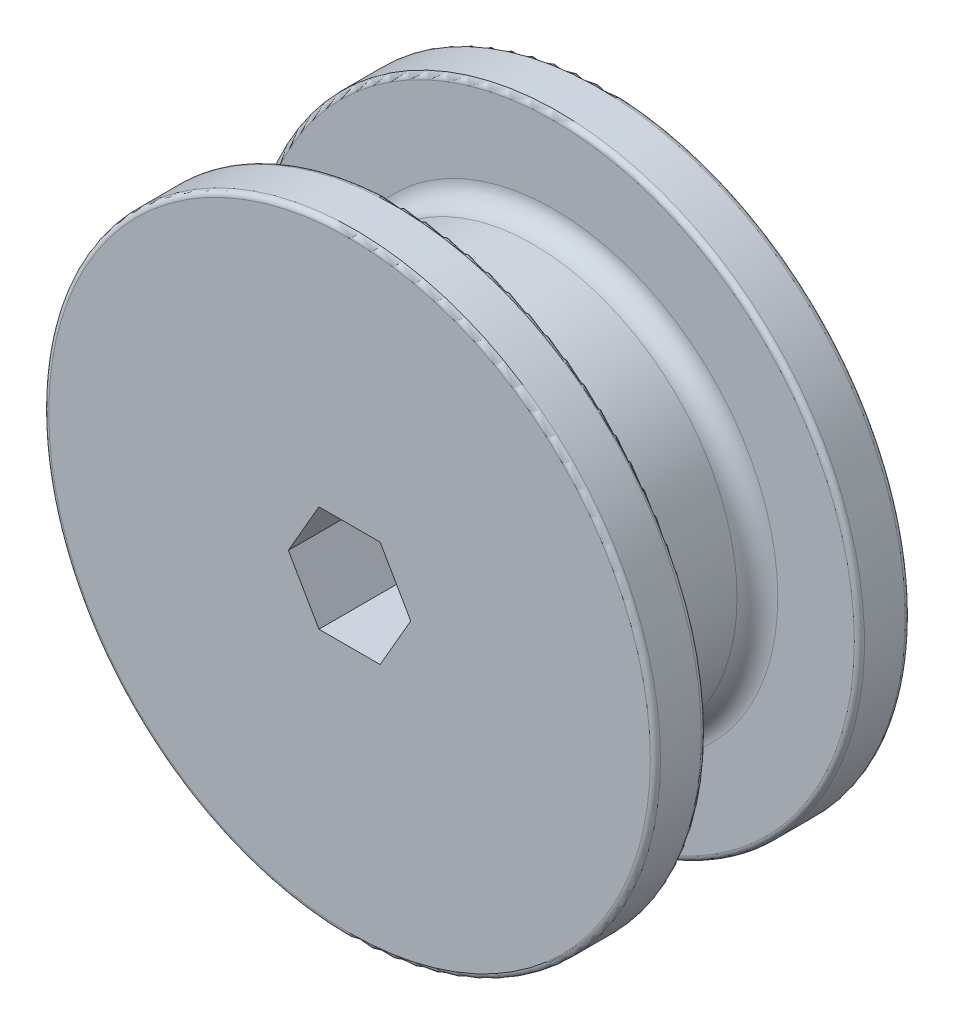
ISO-10303-21;
HEADER;
FILE_DESCRIPTION(('STEP AP214'),'2;1');
FILE_NAME('part.step','',(''),(''),'','','');
FILE_SCHEMA(('AUTOMOTIVE_DESIGN { 1 0 10303 214 1 1 1 1 }'));
ENDSEC;
DATA;
#1=APPLICATION_CONTEXT('core data for automotive mechanical design processes');
#2=APPLICATION_PROTOCOL_DEFINITION('international standard','automotive_design',2000,#1);
#3=PRODUCT_CONTEXT('',#1,'mechanical');
#4=PRODUCT('Part','Part','',(#3));
#5=PRODUCT_RELATED_PRODUCT_CATEGORY('part','',(#4));
#6=PRODUCT_DEFINITION_FORMATION('','',#4);
#7=PRODUCT_DEFINITION_CONTEXT('part definition',#1,'design');
#8=PRODUCT_DEFINITION('design','',#6,#7);
#9=PRODUCT_DEFINITION_SHAPE('','',#8);
#10=(LENGTH_UNIT() NAMED_UNIT(*) SI_UNIT(.MILLI.,.METRE.));
#11=(NAMED_UNIT(*) PLANE_ANGLE_UNIT() SI_UNIT($,.RADIAN.));
#12=(NAMED_UNIT(*) SI_UNIT($,.STERADIAN.) SOLID_ANGLE_UNIT());
#13=UNCERTAINTY_MEASURE_WITH_UNIT(LENGTH_MEASURE(1.E-05),#10,'distance_accuracy_value','');
#14=(GEOMETRIC_REPRESENTATION_CONTEXT(3) GLOBAL_UNCERTAINTY_ASSIGNED_CONTEXT((#13)) GLOBAL_UNIT_ASSIGNED_CONTEXT((#10,
#11,#12)) REPRESENTATION_CONTEXT('',''));
#15=CARTESIAN_POINT('',(0.,0.,0.));
#16=DIRECTION('',(0.,0.,1.));
#17=DIRECTION('',(1.,0.,0.));
#18=AXIS2_PLACEMENT_3D('',#15,#16,#17);
#19=CARTESIAN_POINT('',(0.,0.,19.05));
#20=DIRECTION('',(0.,0.,-1.));
#21=DIRECTION('',(-1.,0.,0.));
#22=AXIS2_PLACEMENT_3D('',#19,#20,#21);
#23=CYLINDRICAL_SURFACE('',#22,25.4);
#24=CARTESIAN_POINT('',(0.,0.,2.54));
#25=DIRECTION('',(0.,0.,-1.));
#26=DIRECTION('',(-1.,0.,0.));
#27=AXIS2_PLACEMENT_3D('',#24,#25,#26);
#28=CIRCLE('',#27,25.4);
#29=CARTESIAN_POINT('',(-25.4,0.,2.54));
#30=VERTEX_POINT('',#29);
#31=EDGE_CURVE('E140',#30,#30,#28,.F.);
#32=ORIENTED_EDGE('',*,*,#31,.T.);
#33=EDGE_LOOP('',(#32));
#34=FACE_BOUND('',#33,.T.);
#35=CARTESIAN_POINT('',(0.,0.,16.51));
#36=DIRECTION('',(0.,0.,1.));
#37=DIRECTION('',(1.,0.,0.));
#38=AXIS2_PLACEMENT_3D('',#35,#36,#37);
#39=CIRCLE('',#38,25.4);
#40=CARTESIAN_POINT('',(25.4,0.,16.51));
#41=VERTEX_POINT('',#40);
#42=EDGE_CURVE('E130',#41,#41,#39,.F.);
#43=ORIENTED_EDGE('',*,*,#42,.T.);
#44=EDGE_LOOP('',(#43));
#45=FACE_BOUND('',#44,.T.);
#46=ADVANCED_FACE('F33',(#34,#45),#23,.T.);
#47=CARTESIAN_POINT('',(0.,0.,25.4));
#48=DIRECTION('',(0.,0.,-1.));
#49=DIRECTION('',(-1.,0.,0.));
#50=AXIS2_PLACEMENT_3D('',#47,#48,#49);
#51=CYLINDRICAL_SURFACE('',#50,38.1);
#52=CARTESIAN_POINT('',(0.,0.,19.685));
#53=DIRECTION('',(0.,0.,1.));
#54=DIRECTION('',(1.,0.,0.));
#55=AXIS2_PLACEMENT_3D('',#52,#53,#54);
#56=CIRCLE('',#55,38.1);
#57=CARTESIAN_POINT('',(38.1,0.,19.685));
#58=VERTEX_POINT('',#57);
#59=EDGE_CURVE('E152',#58,#58,#56,.T.);
#60=ORIENTED_EDGE('',*,*,#59,.T.);
#61=EDGE_LOOP('',(#60));
#62=FACE_BOUND('',#61,.T.);
#63=CARTESIAN_POINT('',(0.,0.,24.765));
#64=DIRECTION('',(0.,0.,1.));
#65=DIRECTION('',(1.,0.,0.));
#66=AXIS2_PLACEMENT_3D('',#63,#64,#65);
#67=CIRCLE('',#66,38.1);
#68=CARTESIAN_POINT('',(38.1,0.,24.765));
#69=VERTEX_POINT('',#68);
#70=EDGE_CURVE('E149',#69,#69,#67,.F.);
#71=ORIENTED_EDGE('',*,*,#70,.T.);
#72=EDGE_LOOP('',(#71));
#73=FACE_BOUND('',#72,.T.);
#74=ADVANCED_FACE('F197',(#62,#73),#51,.T.);
#75=CARTESIAN_POINT('',(0.,0.,25.4));
#76=DIRECTION('',(0.,0.,1.));
#77=DIRECTION('',(1.,0.,0.));
#78=AXIS2_PLACEMENT_3D('',#75,#76,#77);
#79=PLANE('',#78);
#80=CARTESIAN_POINT('',(0.,0.,25.4));
#81=DIRECTION('',(0.,0.,1.));
#82=DIRECTION('',(1.,0.,0.));
#83=AXIS2_PLACEMENT_3D('',#80,#81,#82);
#84=CIRCLE('',#83,37.465);
#85=CARTESIAN_POINT('',(37.465,0.,25.4));
#86=VERTEX_POINT('',#85);
#87=EDGE_CURVE('E158',#86,#86,#84,.T.);
#88=ORIENTED_EDGE('',*,*,#87,.T.);
#89=EDGE_LOOP('',(#88));
#90=FACE_BOUND('',#89,.T.);
#91=DIRECTION('',(0.5,0.866025403784439,0.));
#92=VECTOR('',#91,1.);
#93=CARTESIAN_POINT('',(3.81051177665153,-6.60000000000001,25.4));
#94=LINE('',#93,#92);
#95=CARTESIAN_POINT('',(3.81051177665153,-6.60000000000001,25.4));
#96=VERTEX_POINT('',#95);
#97=CARTESIAN_POINT('',(7.62102355330306,0.,25.4));
#98=VERTEX_POINT('',#97);
#99=EDGE_CURVE('E48',#96,#98,#94,.T.);
#100=ORIENTED_EDGE('',*,*,#99,.F.);
#101=DIRECTION('',(1.,0.,0.));
#102=VECTOR('',#101,1.);
#103=CARTESIAN_POINT('',(-3.81051177665153,-6.6,25.4));
#104=LINE('',#103,#102);
#105=CARTESIAN_POINT('',(-3.81051177665153,-6.6,25.4));
#106=VERTEX_POINT('',#105);
#107=EDGE_CURVE('E104',#106,#96,#104,.T.);
#108=ORIENTED_EDGE('',*,*,#107,.F.);
#109=DIRECTION('',(0.5,-0.866025403784439,0.));
#110=VECTOR('',#109,1.);
#111=CARTESIAN_POINT('',(-7.62102355330307,0.,25.4));
#112=LINE('',#111,#110);
#113=CARTESIAN_POINT('',(-7.62102355330307,0.,25.4));
#114=VERTEX_POINT('',#113);
#115=EDGE_CURVE('E107',#114,#106,#112,.T.);
#116=ORIENTED_EDGE('',*,*,#115,.F.);
#117=DIRECTION('',(-0.5,-0.866025403784439,0.));
#118=VECTOR('',#117,1.);
#119=CARTESIAN_POINT('',(-3.81051177665153,6.60000000000001,25.4));
#120=LINE('',#119,#118);
#121=CARTESIAN_POINT('',(-3.81051177665153,6.60000000000001,25.4));
#122=VERTEX_POINT('',#121);
#123=EDGE_CURVE('E123',#122,#114,#120,.T.);
#124=ORIENTED_EDGE('',*,*,#123,.F.);
#125=DIRECTION('',(-1.,0.,0.));
#126=VECTOR('',#125,1.);
#127=CARTESIAN_POINT('',(3.81051177665153,6.60000000000001,25.4));
#128=LINE('',#127,#126);
#129=CARTESIAN_POINT('',(3.81051177665153,6.60000000000001,25.4));
#130=VERTEX_POINT('',#129);
#131=EDGE_CURVE('E120',#130,#122,#128,.T.);
#132=ORIENTED_EDGE('',*,*,#131,.F.);
#133=DIRECTION('',(-0.5,0.866025403784439,0.));
#134=VECTOR('',#133,1.);
#135=CARTESIAN_POINT('',(7.62102355330306,0.,25.4));
#136=LINE('',#135,#134);
#137=EDGE_CURVE('E118',#98,#130,#136,.T.);
#138=ORIENTED_EDGE('',*,*,#137,.F.);
#139=EDGE_LOOP('',(#100,#108,#116,#124,#132,#138));
#140=FACE_BOUND('',#139,.T.);
#141=ADVANCED_FACE('F205',(#90,#140),#79,.T.);
#142=CARTESIAN_POINT('',(0.,0.,19.05));
#143=DIRECTION('',(0.,0.,1.));
#144=DIRECTION('',(1.,0.,0.));
#145=AXIS2_PLACEMENT_3D('',#142,#143,#144);
#146=PLANE('',#145);
#147=CARTESIAN_POINT('',(0.,0.,19.05));
#148=DIRECTION('',(0.,0.,1.));
#149=DIRECTION('',(1.,0.,0.));
#150=AXIS2_PLACEMENT_3D('',#147,#148,#149);
#151=CIRCLE('',#150,37.465);
#152=CARTESIAN_POINT('',(37.465,0.,19.05));
#153=VERTEX_POINT('',#152);
#154=EDGE_CURVE('E155',#153,#153,#151,.F.);
#155=ORIENTED_EDGE('',*,*,#154,.T.);
#156=EDGE_LOOP('',(#155));
#157=FACE_BOUND('',#156,.T.);
#158=CARTESIAN_POINT('',(0.,0.,19.05));
#159=DIRECTION('',(0.,0.,1.));
#160=DIRECTION('',(1.,0.,0.));
#161=AXIS2_PLACEMENT_3D('',#158,#159,#160);
#162=CIRCLE('',#161,27.94);
#163=CARTESIAN_POINT('',(27.94,0.,19.05));
#164=VERTEX_POINT('',#163);
#165=EDGE_CURVE('E146',#164,#164,#162,.T.);
#166=ORIENTED_EDGE('',*,*,#165,.T.);
#167=EDGE_LOOP('',(#166));
#168=FACE_BOUND('',#167,.T.);
#169=ADVANCED_FACE('F181',(#157,#168),#146,.F.);
#170=CARTESIAN_POINT('',(0.,0.,-6.35));
#171=DIRECTION('',(0.,0.,1.));
#172=DIRECTION('',(1.,0.,0.));
#173=AXIS2_PLACEMENT_3D('',#170,#171,#172);
#174=CYLINDRICAL_SURFACE('',#173,38.1);
#175=CARTESIAN_POINT('',(0.,0.,-0.635));
#176=DIRECTION('',(0.,0.,-1.));
#177=DIRECTION('',(-1.,0.,0.));
#178=AXIS2_PLACEMENT_3D('',#175,#176,#177);
#179=CIRCLE('',#178,38.1);
#180=CARTESIAN_POINT('',(-38.1,0.,-0.635));
#181=VERTEX_POINT('',#180);
#182=EDGE_CURVE('E164',#181,#181,#179,.T.);
#183=ORIENTED_EDGE('',*,*,#182,.T.);
#184=EDGE_LOOP('',(#183));
#185=FACE_BOUND('',#184,.T.);
#186=CARTESIAN_POINT('',(0.,0.,-5.715));
#187=DIRECTION('',(0.,0.,-1.));
#188=DIRECTION('',(-1.,0.,0.));
#189=AXIS2_PLACEMENT_3D('',#186,#187,#188);
#190=CIRCLE('',#189,38.1);
#191=CARTESIAN_POINT('',(-38.1,0.,-5.715));
#192=VERTEX_POINT('',#191);
#193=EDGE_CURVE('E161',#192,#192,#190,.F.);
#194=ORIENTED_EDGE('',*,*,#193,.T.);
#195=EDGE_LOOP('',(#194));
#196=FACE_BOUND('',#195,.T.);
#197=ADVANCED_FACE('F178',(#185,#196),#174,.T.);
#198=CARTESIAN_POINT('',(0.,0.,-6.35));
#199=DIRECTION('',(0.,0.,-1.));
#200=DIRECTION('',(-1.,0.,0.));
#201=AXIS2_PLACEMENT_3D('',#198,#199,#200);
#202=PLANE('',#201);
#203=CARTESIAN_POINT('',(0.,0.,-6.35));
#204=DIRECTION('',(0.,0.,-1.));
#205=DIRECTION('',(-1.,0.,0.));
#206=AXIS2_PLACEMENT_3D('',#203,#204,#205);
#207=CIRCLE('',#206,37.465);
#208=CARTESIAN_POINT('',(-37.465,0.,-6.35));
#209=VERTEX_POINT('',#208);
#210=EDGE_CURVE('E11',#209,#209,#207,.T.);
#211=ORIENTED_EDGE('',*,*,#210,.T.);
#212=EDGE_LOOP('',(#211));
#213=FACE_BOUND('',#212,.T.);
#214=DIRECTION('',(0.5,0.866025403784439,0.));
#215=VECTOR('',#214,1.);
#216=CARTESIAN_POINT('',(3.81051177665153,-6.60000000000001,-6.35));
#217=LINE('',#216,#215);
#218=CARTESIAN_POINT('',(3.81051177665153,-6.60000000000001,-6.35));
#219=VERTEX_POINT('',#218);
#220=CARTESIAN_POINT('',(7.62102355330306,0.,-6.35));
#221=VERTEX_POINT('',#220);
#222=EDGE_CURVE('E88',#219,#221,#217,.T.);
#223=ORIENTED_EDGE('',*,*,#222,.T.);
#224=DIRECTION('',(-0.5,0.866025403784439,0.));
#225=VECTOR('',#224,1.);
#226=CARTESIAN_POINT('',(7.62102355330306,0.,-6.35));
#227=LINE('',#226,#225);
#228=CARTESIAN_POINT('',(3.81051177665152,6.60000000000001,-6.35));
#229=VERTEX_POINT('',#228);
#230=EDGE_CURVE('E97',#221,#229,#227,.T.);
#231=ORIENTED_EDGE('',*,*,#230,.T.);
#232=DIRECTION('',(-1.,0.,0.));
#233=VECTOR('',#232,1.);
#234=CARTESIAN_POINT('',(3.81051177665153,6.60000000000001,-6.35));
#235=LINE('',#234,#233);
#236=CARTESIAN_POINT('',(-3.81051177665153,6.60000000000001,-6.35));
#237=VERTEX_POINT('',#236);
#238=EDGE_CURVE('E56',#229,#237,#235,.T.);
#239=ORIENTED_EDGE('',*,*,#238,.T.);
#240=DIRECTION('',(-0.5,-0.866025403784439,0.));
#241=VECTOR('',#240,1.);
#242=CARTESIAN_POINT('',(-3.81051177665153,6.60000000000001,-6.35));
#243=LINE('',#242,#241);
#244=CARTESIAN_POINT('',(-7.62102355330307,0.,-6.35));
#245=VERTEX_POINT('',#244);
#246=EDGE_CURVE('E111',#237,#245,#243,.T.);
#247=ORIENTED_EDGE('',*,*,#246,.T.);
#248=DIRECTION('',(0.5,-0.866025403784439,0.));
#249=VECTOR('',#248,1.);
#250=CARTESIAN_POINT('',(-7.62102355330307,0.,-6.35));
#251=LINE('',#250,#249);
#252=CARTESIAN_POINT('',(-3.81051177665153,-6.6,-6.35));
#253=VERTEX_POINT('',#252);
#254=EDGE_CURVE('E114',#245,#253,#251,.T.);
#255=ORIENTED_EDGE('',*,*,#254,.T.);
#256=DIRECTION('',(1.,0.,0.));
#257=VECTOR('',#256,1.);
#258=CARTESIAN_POINT('',(-3.81051177665153,-6.6,-6.35));
#259=LINE('',#258,#257);
#260=EDGE_CURVE('E94',#253,#219,#259,.T.);
#261=ORIENTED_EDGE('',*,*,#260,.T.);
#262=EDGE_LOOP('',(#223,#231,#239,#247,#255,#261));
#263=FACE_BOUND('',#262,.T.);
#264=ADVANCED_FACE('F101',(#213,#263),#202,.T.);
#265=CARTESIAN_POINT('',(0.,0.,0.));
#266=DIRECTION('',(0.,0.,-1.));
#267=DIRECTION('',(-1.,0.,0.));
#268=AXIS2_PLACEMENT_3D('',#265,#266,#267);
#269=PLANE('',#268);
#270=CARTESIAN_POINT('',(0.,0.,0.));
#271=DIRECTION('',(0.,0.,-1.));
#272=DIRECTION('',(-1.,0.,0.));
#273=AXIS2_PLACEMENT_3D('',#270,#271,#272);
#274=CIRCLE('',#273,37.465);
#275=CARTESIAN_POINT('',(-37.465,0.,0.));
#276=VERTEX_POINT('',#275);
#277=EDGE_CURVE('E41',#276,#276,#274,.F.);
#278=ORIENTED_EDGE('',*,*,#277,.T.);
#279=EDGE_LOOP('',(#278));
#280=FACE_BOUND('',#279,.T.);
#281=CARTESIAN_POINT('',(0.,0.,0.));
#282=DIRECTION('',(0.,0.,-1.));
#283=DIRECTION('',(-1.,0.,0.));
#284=AXIS2_PLACEMENT_3D('',#281,#282,#283);
#285=CIRCLE('',#284,27.94);
#286=CARTESIAN_POINT('',(-27.94,0.,0.));
#287=VERTEX_POINT('',#286);
#288=EDGE_CURVE('E143',#287,#287,#285,.T.);
#289=ORIENTED_EDGE('',*,*,#288,.T.);
#290=EDGE_LOOP('',(#289));
#291=FACE_BOUND('',#290,.T.);
#292=ADVANCED_FACE('F169',(#280,#291),#269,.F.);
#293=CARTESIAN_POINT('',(3.81051177665153,-6.60000000000001,-6.35));
#294=DIRECTION('',(0.866025403784439,-0.5,0.));
#295=DIRECTION('',(0.5,0.866025403784439,0.));
#296=AXIS2_PLACEMENT_3D('',#293,#294,#295);
#297=PLANE('',#296);
#298=ORIENTED_EDGE('',*,*,#99,.T.);
#299=DIRECTION('',(0.,0.,1.));
#300=VECTOR('',#299,1.);
#301=CARTESIAN_POINT('',(7.62102355330306,0.,-6.35));
#302=LINE('',#301,#300);
#303=EDGE_CURVE('E84',#221,#98,#302,.T.);
#304=ORIENTED_EDGE('',*,*,#303,.F.);
#305=ORIENTED_EDGE('',*,*,#222,.F.);
#306=DIRECTION('',(0.,0.,1.));
#307=VECTOR('',#306,1.);
#308=CARTESIAN_POINT('',(3.81051177665153,-6.60000000000001,-6.35));
#309=LINE('',#308,#307);
#310=EDGE_CURVE('E128',#219,#96,#309,.T.);
#311=ORIENTED_EDGE('',*,*,#310,.T.);
#312=EDGE_LOOP('',(#298,#304,#305,#311));
#313=FACE_BOUND('',#312,.T.);
#314=ADVANCED_FACE('F86',(#313),#297,.F.);
#315=CARTESIAN_POINT('',(-3.81051177665153,-6.6,-6.35));
#316=DIRECTION('',(0.,-1.,0.));
#317=DIRECTION('',(1.,0.,0.));
#318=AXIS2_PLACEMENT_3D('',#315,#316,#317);
#319=PLANE('',#318);
#320=ORIENTED_EDGE('',*,*,#107,.T.);
#321=ORIENTED_EDGE('',*,*,#310,.F.);
#322=ORIENTED_EDGE('',*,*,#260,.F.);
#323=DIRECTION('',(0.,0.,1.));
#324=VECTOR('',#323,1.);
#325=CARTESIAN_POINT('',(-3.81051177665153,-6.6,-6.35));
#326=LINE('',#325,#324);
#327=EDGE_CURVE('E131',#253,#106,#326,.T.);
#328=ORIENTED_EDGE('',*,*,#327,.T.);
#329=EDGE_LOOP('',(#320,#321,#322,#328));
#330=FACE_BOUND('',#329,.T.);
#331=ADVANCED_FACE('F246',(#330),#319,.F.);
#332=CARTESIAN_POINT('',(-7.62102355330307,0.,-6.35));
#333=DIRECTION('',(-0.866025403784438,-0.5,0.));
#334=DIRECTION('',(0.5,-0.866025403784439,0.));
#335=AXIS2_PLACEMENT_3D('',#332,#333,#334);
#336=PLANE('',#335);
#337=ORIENTED_EDGE('',*,*,#115,.T.);
#338=ORIENTED_EDGE('',*,*,#327,.F.);
#339=ORIENTED_EDGE('',*,*,#254,.F.);
#340=DIRECTION('',(0.,0.,1.));
#341=VECTOR('',#340,1.);
#342=CARTESIAN_POINT('',(-7.62102355330307,0.,-6.35));
#343=LINE('',#342,#341);
#344=EDGE_CURVE('E133',#245,#114,#343,.T.);
#345=ORIENTED_EDGE('',*,*,#344,.T.);
#346=EDGE_LOOP('',(#337,#338,#339,#345));
#347=FACE_BOUND('',#346,.T.);
#348=ADVANCED_FACE('F244',(#347),#336,.F.);
#349=CARTESIAN_POINT('',(-3.81051177665153,6.60000000000001,-6.35));
#350=DIRECTION('',(-0.866025403784439,0.5,0.));
#351=DIRECTION('',(-0.5,-0.866025403784439,0.));
#352=AXIS2_PLACEMENT_3D('',#349,#350,#351);
#353=PLANE('',#352);
#354=ORIENTED_EDGE('',*,*,#123,.T.);
#355=ORIENTED_EDGE('',*,*,#344,.F.);
#356=ORIENTED_EDGE('',*,*,#246,.F.);
#357=DIRECTION('',(0.,0.,1.));
#358=VECTOR('',#357,1.);
#359=CARTESIAN_POINT('',(-3.81051177665153,6.60000000000001,-6.35));
#360=LINE('',#359,#358);
#361=EDGE_CURVE('E135',#237,#122,#360,.T.);
#362=ORIENTED_EDGE('',*,*,#361,.T.);
#363=EDGE_LOOP('',(#354,#355,#356,#362));
#364=FACE_BOUND('',#363,.T.);
#365=ADVANCED_FACE('F241',(#364),#353,.F.);
#366=CARTESIAN_POINT('',(3.81051177665153,6.60000000000001,-6.35));
#367=DIRECTION('',(0.,1.,0.));
#368=DIRECTION('',(-1.,0.,0.));
#369=AXIS2_PLACEMENT_3D('',#366,#367,#368);
#370=PLANE('',#369);
#371=ORIENTED_EDGE('',*,*,#131,.T.);
#372=ORIENTED_EDGE('',*,*,#361,.F.);
#373=ORIENTED_EDGE('',*,*,#238,.F.);
#374=DIRECTION('',(0.,0.,1.));
#375=VECTOR('',#374,1.);
#376=CARTESIAN_POINT('',(3.81051177665153,6.60000000000001,-6.35));
#377=LINE('',#376,#375);
#378=EDGE_CURVE('E93',#229,#130,#377,.T.);
#379=ORIENTED_EDGE('',*,*,#378,.T.);
#380=EDGE_LOOP('',(#371,#372,#373,#379));
#381=FACE_BOUND('',#380,.T.);
#382=ADVANCED_FACE('F238',(#381),#370,.F.);
#383=CARTESIAN_POINT('',(7.62102355330306,0.,-6.35));
#384=DIRECTION('',(0.866025403784439,0.5,0.));
#385=DIRECTION('',(-0.5,0.866025403784439,0.));
#386=AXIS2_PLACEMENT_3D('',#383,#384,#385);
#387=PLANE('',#386);
#388=ORIENTED_EDGE('',*,*,#137,.T.);
#389=ORIENTED_EDGE('',*,*,#378,.F.);
#390=ORIENTED_EDGE('',*,*,#230,.F.);
#391=ORIENTED_EDGE('',*,*,#303,.T.);
#392=EDGE_LOOP('',(#388,#389,#390,#391));
#393=FACE_BOUND('',#392,.T.);
#394=ADVANCED_FACE('F98',(#393),#387,.F.);
#395=CARTESIAN_POINT('',(0.,0.,2.54));
#396=DIRECTION('',(0.,0.,-1.));
#397=DIRECTION('',(-1.,0.,0.));
#398=AXIS2_PLACEMENT_3D('',#395,#396,#397);
#399=TOROIDAL_SURFACE('',#398,27.94,2.54);
#400=ORIENTED_EDGE('',*,*,#288,.F.);
#401=EDGE_LOOP('',(#400));
#402=FACE_BOUND('',#401,.T.);
#403=ORIENTED_EDGE('',*,*,#31,.F.);
#404=EDGE_LOOP('',(#403));
#405=FACE_BOUND('',#404,.T.);
#406=ADVANCED_FACE('F211',(#402,#405),#399,.F.);
#407=CARTESIAN_POINT('',(0.,0.,16.51));
#408=DIRECTION('',(0.,0.,1.));
#409=DIRECTION('',(1.,0.,0.));
#410=AXIS2_PLACEMENT_3D('',#407,#408,#409);
#411=TOROIDAL_SURFACE('',#410,27.94,2.54);
#412=ORIENTED_EDGE('',*,*,#42,.F.);
#413=EDGE_LOOP('',(#412));
#414=FACE_BOUND('',#413,.T.);
#415=ORIENTED_EDGE('',*,*,#165,.F.);
#416=EDGE_LOOP('',(#415));
#417=FACE_BOUND('',#416,.T.);
#418=ADVANCED_FACE('F214',(#414,#417),#411,.F.);
#419=CARTESIAN_POINT('',(0.,0.,19.685));
#420=DIRECTION('',(0.,0.,1.));
#421=DIRECTION('',(1.,0.,0.));
#422=AXIS2_PLACEMENT_3D('',#419,#420,#421);
#423=TOROIDAL_SURFACE('',#422,37.465,0.635);
#424=ORIENTED_EDGE('',*,*,#154,.F.);
#425=EDGE_LOOP('',(#424));
#426=FACE_BOUND('',#425,.T.);
#427=ORIENTED_EDGE('',*,*,#59,.F.);
#428=EDGE_LOOP('',(#427));
#429=FACE_BOUND('',#428,.T.);
#430=ADVANCED_FACE('F218',(#426,#429),#423,.T.);
#431=CARTESIAN_POINT('',(0.,0.,24.765));
#432=DIRECTION('',(0.,0.,1.));
#433=DIRECTION('',(1.,0.,0.));
#434=AXIS2_PLACEMENT_3D('',#431,#432,#433);
#435=TOROIDAL_SURFACE('',#434,37.465,0.635);
#436=ORIENTED_EDGE('',*,*,#70,.F.);
#437=EDGE_LOOP('',(#436));
#438=FACE_BOUND('',#437,.T.);
#439=ORIENTED_EDGE('',*,*,#87,.F.);
#440=EDGE_LOOP('',(#439));
#441=FACE_BOUND('',#440,.T.);
#442=ADVANCED_FACE('F175',(#438,#441),#435,.T.);
#443=CARTESIAN_POINT('',(0.,0.,-0.635));
#444=DIRECTION('',(0.,0.,-1.));
#445=DIRECTION('',(-1.,0.,0.));
#446=AXIS2_PLACEMENT_3D('',#443,#444,#445);
#447=TOROIDAL_SURFACE('',#446,37.465,0.635);
#448=ORIENTED_EDGE('',*,*,#277,.F.);
#449=EDGE_LOOP('',(#448));
#450=FACE_BOUND('',#449,.T.);
#451=ORIENTED_EDGE('',*,*,#182,.F.);
#452=EDGE_LOOP('',(#451));
#453=FACE_BOUND('',#452,.T.);
#454=ADVANCED_FACE('F172',(#450,#453),#447,.T.);
#455=CARTESIAN_POINT('',(0.,0.,-5.715));
#456=DIRECTION('',(0.,0.,-1.));
#457=DIRECTION('',(-1.,0.,0.));
#458=AXIS2_PLACEMENT_3D('',#455,#456,#457);
#459=TOROIDAL_SURFACE('',#458,37.465,0.635);
#460=ORIENTED_EDGE('',*,*,#193,.F.);
#461=EDGE_LOOP('',(#460));
#462=FACE_BOUND('',#461,.T.);
#463=ORIENTED_EDGE('',*,*,#210,.F.);
#464=EDGE_LOOP('',(#463));
#465=FACE_BOUND('',#464,.T.);
#466=ADVANCED_FACE('F35',(#462,#465),#459,.T.);
#467=CLOSED_SHELL('',(#46,#74,#141,#169,#197,#264,#292,#314,#331,#348,#365,#382,#394,#406,#418,
#430,#442,#454,#466));
#468=MANIFOLD_SOLID_BREP('B2',#467);
#469=ADVANCED_BREP_SHAPE_REPRESENTATION('',(#18,#468),#14);
#470=SHAPE_DEFINITION_REPRESENTATION(#9,#469);
ENDSEC;
END-ISO-10303-21;
